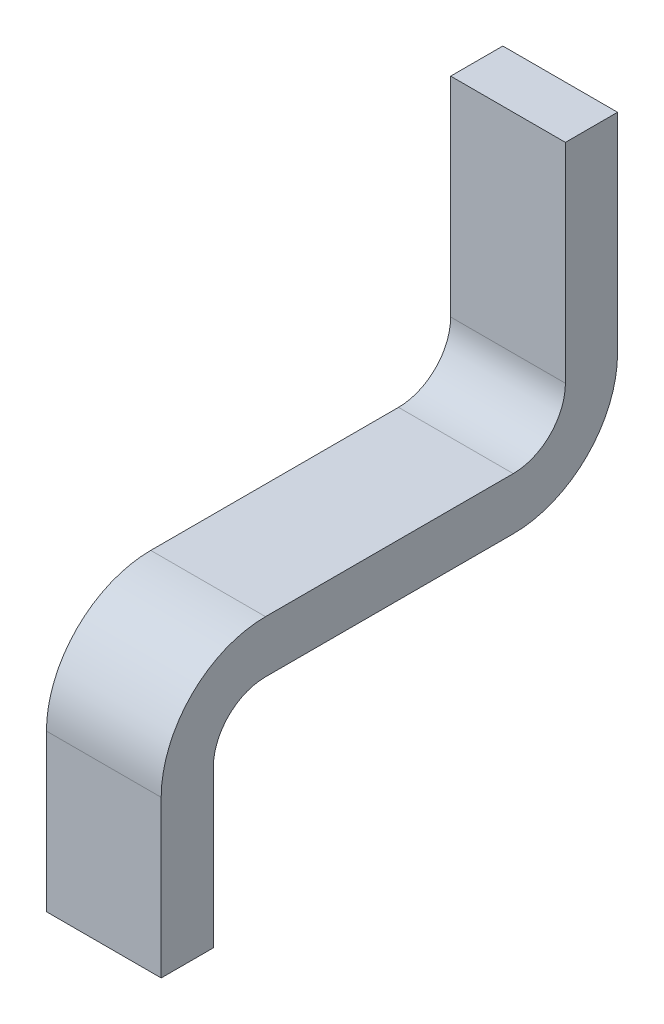
ISO-10303-21;
HEADER;
FILE_DESCRIPTION(('STEP AP214'),'2;1');
FILE_NAME('part.step','',(''),(''),'','','');
FILE_SCHEMA(('AUTOMOTIVE_DESIGN { 1 0 10303 214 1 1 1 1 }'));
ENDSEC;
DATA;
#1=APPLICATION_CONTEXT('core data for automotive mechanical design processes');
#2=APPLICATION_PROTOCOL_DEFINITION('international standard','automotive_design',2000,#1);
#3=PRODUCT_CONTEXT('',#1,'mechanical');
#4=PRODUCT('Part','Part','',(#3));
#5=PRODUCT_RELATED_PRODUCT_CATEGORY('part','',(#4));
#6=PRODUCT_DEFINITION_FORMATION('','',#4);
#7=PRODUCT_DEFINITION_CONTEXT('part definition',#1,'design');
#8=PRODUCT_DEFINITION('design','',#6,#7);
#9=PRODUCT_DEFINITION_SHAPE('','',#8);
#10=(LENGTH_UNIT() NAMED_UNIT(*) SI_UNIT(.MILLI.,.METRE.));
#11=(NAMED_UNIT(*) PLANE_ANGLE_UNIT() SI_UNIT($,.RADIAN.));
#12=(NAMED_UNIT(*) SI_UNIT($,.STERADIAN.) SOLID_ANGLE_UNIT());
#13=UNCERTAINTY_MEASURE_WITH_UNIT(LENGTH_MEASURE(1.E-05),#10,'distance_accuracy_value','');
#14=(GEOMETRIC_REPRESENTATION_CONTEXT(3) GLOBAL_UNCERTAINTY_ASSIGNED_CONTEXT((#13)) GLOBAL_UNIT_ASSIGNED_CONTEXT((#10,
#11,#12)) REPRESENTATION_CONTEXT('',''));
#15=CARTESIAN_POINT('',(0.,0.,0.));
#16=DIRECTION('',(0.,0.,1.));
#17=DIRECTION('',(1.,0.,0.));
#18=AXIS2_PLACEMENT_3D('',#15,#16,#17);
#19=CARTESIAN_POINT('',(1.36,4.,0.675));
#20=DIRECTION('',(-1.,0.,0.));
#21=DIRECTION('',(0.,-1.,0.));
#22=AXIS2_PLACEMENT_3D('',#19,#20,#21);
#23=PLANE('',#22);
#24=CARTESIAN_POINT('',(1.36,3.8,0.675));
#25=DIRECTION('',(1.,0.,0.));
#26=DIRECTION('',(0.,1.,0.));
#27=AXIS2_PLACEMENT_3D('',#24,#25,#26);
#28=CIRCLE('',#27,0.2);
#29=CARTESIAN_POINT('',(1.36,3.8,0.875));
#30=VERTEX_POINT('',#29);
#31=CARTESIAN_POINT('',(1.36,4.,0.675));
#32=VERTEX_POINT('',#31);
#33=EDGE_CURVE('E150',#30,#32,#28,.F.);
#34=ORIENTED_EDGE('',*,*,#33,.F.);
#35=DIRECTION('',(0.,1.,0.));
#36=VECTOR('',#35,1.);
#37=CARTESIAN_POINT('',(1.36,3.5,0.875));
#38=LINE('',#37,#36);
#39=CARTESIAN_POINT('',(1.36,3.5,0.875));
#40=VERTEX_POINT('',#39);
#41=EDGE_CURVE('E147',#30,#40,#38,.F.);
#42=ORIENTED_EDGE('',*,*,#41,.T.);
#43=DIRECTION('',(0.,0.,1.));
#44=VECTOR('',#43,1.);
#45=CARTESIAN_POINT('',(1.36,3.5,0.775));
#46=LINE('',#45,#44);
#47=CARTESIAN_POINT('',(1.36,3.5,0.775));
#48=VERTEX_POINT('',#47);
#49=EDGE_CURVE('E141',#48,#40,#46,.T.);
#50=ORIENTED_EDGE('',*,*,#49,.F.);
#51=DIRECTION('',(0.,1.,0.));
#52=VECTOR('',#51,1.);
#53=CARTESIAN_POINT('',(1.36,3.5,0.775));
#54=LINE('',#53,#52);
#55=CARTESIAN_POINT('',(1.36,3.8,0.775));
#56=VERTEX_POINT('',#55);
#57=EDGE_CURVE('E115',#48,#56,#54,.T.);
#58=ORIENTED_EDGE('',*,*,#57,.T.);
#59=CARTESIAN_POINT('',(1.36,3.8,0.675));
#60=DIRECTION('',(1.,0.,0.));
#61=DIRECTION('',(0.,1.,0.));
#62=AXIS2_PLACEMENT_3D('',#59,#60,#61);
#63=CIRCLE('',#62,0.1);
#64=CARTESIAN_POINT('',(1.36,3.9,0.675));
#65=VERTEX_POINT('',#64);
#66=EDGE_CURVE('E215',#56,#65,#63,.F.);
#67=ORIENTED_EDGE('',*,*,#66,.T.);
#68=DIRECTION('',(0.,0.,1.));
#69=VECTOR('',#68,1.);
#70=CARTESIAN_POINT('',(1.36,3.9,0.675));
#71=LINE('',#70,#69);
#72=CARTESIAN_POINT('',(1.36,3.9,0.2));
#73=VERTEX_POINT('',#72);
#74=EDGE_CURVE('E181',#65,#73,#71,.F.);
#75=ORIENTED_EDGE('',*,*,#74,.T.);
#76=CARTESIAN_POINT('',(1.36,4.1,0.2));
#77=DIRECTION('',(-1.,0.,0.));
#78=DIRECTION('',(0.,-1.,0.));
#79=AXIS2_PLACEMENT_3D('',#76,#77,#78);
#80=CIRCLE('',#79,0.2);
#81=CARTESIAN_POINT('',(1.36,4.1,0.));
#82=VERTEX_POINT('',#81);
#83=EDGE_CURVE('E20',#82,#73,#80,.T.);
#84=ORIENTED_EDGE('',*,*,#83,.F.);
#85=DIRECTION('',(0.,1.,0.));
#86=VECTOR('',#85,1.);
#87=CARTESIAN_POINT('',(1.36,4.1,0.));
#88=LINE('',#87,#86);
#89=CARTESIAN_POINT('',(1.36,4.5,0.));
#90=VERTEX_POINT('',#89);
#91=EDGE_CURVE('E91',#82,#90,#88,.T.);
#92=ORIENTED_EDGE('',*,*,#91,.T.);
#93=DIRECTION('',(0.,0.,1.));
#94=VECTOR('',#93,1.);
#95=CARTESIAN_POINT('',(1.36,4.5,0.));
#96=LINE('',#95,#94);
#97=CARTESIAN_POINT('',(1.36,4.5,0.1));
#98=VERTEX_POINT('',#97);
#99=EDGE_CURVE('E163',#90,#98,#96,.T.);
#100=ORIENTED_EDGE('',*,*,#99,.T.);
#101=DIRECTION('',(0.,1.,0.));
#102=VECTOR('',#101,1.);
#103=CARTESIAN_POINT('',(1.36,4.1,0.1));
#104=LINE('',#103,#102);
#105=CARTESIAN_POINT('',(1.36,4.1,0.1));
#106=VERTEX_POINT('',#105);
#107=EDGE_CURVE('E159',#98,#106,#104,.F.);
#108=ORIENTED_EDGE('',*,*,#107,.T.);
#109=CARTESIAN_POINT('',(1.36,4.1,0.2));
#110=DIRECTION('',(-1.,0.,0.));
#111=DIRECTION('',(0.,-1.,0.));
#112=AXIS2_PLACEMENT_3D('',#109,#110,#111);
#113=CIRCLE('',#112,0.1);
#114=CARTESIAN_POINT('',(1.36,4.,0.2));
#115=VERTEX_POINT('',#114);
#116=EDGE_CURVE('E155',#106,#115,#113,.T.);
#117=ORIENTED_EDGE('',*,*,#116,.T.);
#118=DIRECTION('',(0.,0.,1.));
#119=VECTOR('',#118,1.);
#120=CARTESIAN_POINT('',(1.36,4.,0.675));
#121=LINE('',#120,#119);
#122=EDGE_CURVE('E154',#115,#32,#121,.T.);
#123=ORIENTED_EDGE('',*,*,#122,.T.);
#124=EDGE_LOOP('',(#34,#42,#50,#58,#67,#75,#84,#92,#100,#108,#117,#123));
#125=FACE_BOUND('',#124,.T.);
#126=ADVANCED_FACE('F17',(#125),#23,.F.);
#127=CARTESIAN_POINT('',(1.36,4.1,0.2));
#128=DIRECTION('',(-1.,0.,0.));
#129=DIRECTION('',(0.,-1.,0.));
#130=AXIS2_PLACEMENT_3D('',#127,#128,#129);
#131=CYLINDRICAL_SURFACE('',#130,0.2);
#132=CARTESIAN_POINT('',(1.14,4.1,0.2));
#133=DIRECTION('',(-1.,0.,0.));
#134=DIRECTION('',(0.,-1.,0.));
#135=AXIS2_PLACEMENT_3D('',#132,#133,#134);
#136=CIRCLE('',#135,0.2);
#137=CARTESIAN_POINT('',(1.14,3.9,0.2));
#138=VERTEX_POINT('',#137);
#139=CARTESIAN_POINT('',(1.14,4.1,0.));
#140=VERTEX_POINT('',#139);
#141=EDGE_CURVE('E183',#138,#140,#136,.F.);
#142=ORIENTED_EDGE('',*,*,#141,.T.);
#143=DIRECTION('',(1.,0.,0.));
#144=VECTOR('',#143,1.);
#145=CARTESIAN_POINT('',(1.36,4.1,0.));
#146=LINE('',#145,#144);
#147=EDGE_CURVE('E178',#140,#82,#146,.T.);
#148=ORIENTED_EDGE('',*,*,#147,.T.);
#149=ORIENTED_EDGE('',*,*,#83,.T.);
#150=DIRECTION('',(-1.,0.,0.));
#151=VECTOR('',#150,1.);
#152=CARTESIAN_POINT('',(1.36,3.9,0.2));
#153=LINE('',#152,#151);
#154=EDGE_CURVE('E217',#73,#138,#153,.T.);
#155=ORIENTED_EDGE('',*,*,#154,.T.);
#156=EDGE_LOOP('',(#142,#148,#149,#155));
#157=FACE_BOUND('',#156,.T.);
#158=ADVANCED_FACE('F254',(#157),#131,.T.);
#159=CARTESIAN_POINT('',(1.36,4.1,0.));
#160=DIRECTION('',(0.,0.,1.));
#161=DIRECTION('',(1.,0.,0.));
#162=AXIS2_PLACEMENT_3D('',#159,#160,#161);
#163=PLANE('',#162);
#164=ORIENTED_EDGE('',*,*,#147,.F.);
#165=DIRECTION('',(0.,1.,0.));
#166=VECTOR('',#165,1.);
#167=CARTESIAN_POINT('',(1.14,3.9,0.));
#168=LINE('',#167,#166);
#169=CARTESIAN_POINT('',(1.14,4.5,0.));
#170=VERTEX_POINT('',#169);
#171=EDGE_CURVE('E170',#140,#170,#168,.T.);
#172=ORIENTED_EDGE('',*,*,#171,.T.);
#173=DIRECTION('',(1.,0.,0.));
#174=VECTOR('',#173,1.);
#175=CARTESIAN_POINT('',(1.36,4.5,0.));
#176=LINE('',#175,#174);
#177=EDGE_CURVE('E173',#170,#90,#176,.T.);
#178=ORIENTED_EDGE('',*,*,#177,.T.);
#179=ORIENTED_EDGE('',*,*,#91,.F.);
#180=EDGE_LOOP('',(#164,#172,#178,#179));
#181=FACE_BOUND('',#180,.T.);
#182=ADVANCED_FACE('F257',(#181),#163,.F.);
#183=CARTESIAN_POINT('',(1.36,4.5,0.));
#184=DIRECTION('',(0.,-1.,0.));
#185=DIRECTION('',(1.,0.,0.));
#186=AXIS2_PLACEMENT_3D('',#183,#184,#185);
#187=PLANE('',#186);
#188=DIRECTION('',(-1.,0.,0.));
#189=VECTOR('',#188,1.);
#190=CARTESIAN_POINT('',(1.14,4.5,0.1));
#191=LINE('',#190,#189);
#192=CARTESIAN_POINT('',(1.14,4.5,0.1));
#193=VERTEX_POINT('',#192);
#194=EDGE_CURVE('E160',#193,#98,#191,.F.);
#195=ORIENTED_EDGE('',*,*,#194,.T.);
#196=ORIENTED_EDGE('',*,*,#99,.F.);
#197=ORIENTED_EDGE('',*,*,#177,.F.);
#198=DIRECTION('',(0.,0.,1.));
#199=VECTOR('',#198,1.);
#200=CARTESIAN_POINT('',(1.14,4.5,0.675));
#201=LINE('',#200,#199);
#202=EDGE_CURVE('E166',#170,#193,#201,.T.);
#203=ORIENTED_EDGE('',*,*,#202,.T.);
#204=EDGE_LOOP('',(#195,#196,#197,#203));
#205=FACE_BOUND('',#204,.T.);
#206=ADVANCED_FACE('F259',(#205),#187,.F.);
#207=CARTESIAN_POINT('',(1.14,4.1,0.1));
#208=DIRECTION('',(0.,0.,-1.));
#209=DIRECTION('',(-1.,0.,0.));
#210=AXIS2_PLACEMENT_3D('',#207,#208,#209);
#211=PLANE('',#210);
#212=DIRECTION('',(-1.,0.,0.));
#213=VECTOR('',#212,1.);
#214=CARTESIAN_POINT('',(1.14,4.1,0.1));
#215=LINE('',#214,#213);
#216=CARTESIAN_POINT('',(1.14,4.1,0.1));
#217=VERTEX_POINT('',#216);
#218=EDGE_CURVE('E156',#217,#106,#215,.F.);
#219=ORIENTED_EDGE('',*,*,#218,.T.);
#220=ORIENTED_EDGE('',*,*,#107,.F.);
#221=ORIENTED_EDGE('',*,*,#194,.F.);
#222=DIRECTION('',(0.,1.,0.));
#223=VECTOR('',#222,1.);
#224=CARTESIAN_POINT('',(1.14,3.9,0.1));
#225=LINE('',#224,#223);
#226=EDGE_CURVE('E169',#193,#217,#225,.F.);
#227=ORIENTED_EDGE('',*,*,#226,.T.);
#228=EDGE_LOOP('',(#219,#220,#221,#227));
#229=FACE_BOUND('',#228,.T.);
#230=ADVANCED_FACE('F234',(#229),#211,.F.);
#231=CARTESIAN_POINT('',(1.14,4.1,0.2));
#232=DIRECTION('',(-1.,0.,0.));
#233=DIRECTION('',(0.,-1.,0.));
#234=AXIS2_PLACEMENT_3D('',#231,#232,#233);
#235=CYLINDRICAL_SURFACE('',#234,0.1);
#236=DIRECTION('',(1.,0.,0.));
#237=VECTOR('',#236,1.);
#238=CARTESIAN_POINT('',(1.14,4.,0.2));
#239=LINE('',#238,#237);
#240=CARTESIAN_POINT('',(1.14,4.,0.2));
#241=VERTEX_POINT('',#240);
#242=EDGE_CURVE('E151',#241,#115,#239,.T.);
#243=ORIENTED_EDGE('',*,*,#242,.T.);
#244=ORIENTED_EDGE('',*,*,#116,.F.);
#245=ORIENTED_EDGE('',*,*,#218,.F.);
#246=CARTESIAN_POINT('',(1.14,4.1,0.2));
#247=DIRECTION('',(-1.,0.,0.));
#248=DIRECTION('',(0.,-1.,0.));
#249=AXIS2_PLACEMENT_3D('',#246,#247,#248);
#250=CIRCLE('',#249,0.1);
#251=EDGE_CURVE('E210',#217,#241,#250,.T.);
#252=ORIENTED_EDGE('',*,*,#251,.T.);
#253=EDGE_LOOP('',(#243,#244,#245,#252));
#254=FACE_BOUND('',#253,.T.);
#255=ADVANCED_FACE('F227',(#254),#235,.F.);
#256=CARTESIAN_POINT('',(1.14,4.,0.675));
#257=DIRECTION('',(0.,-1.,0.));
#258=DIRECTION('',(1.,0.,0.));
#259=AXIS2_PLACEMENT_3D('',#256,#257,#258);
#260=PLANE('',#259);
#261=DIRECTION('',(1.,0.,0.));
#262=VECTOR('',#261,1.);
#263=CARTESIAN_POINT('',(1.14,4.,0.675));
#264=LINE('',#263,#262);
#265=CARTESIAN_POINT('',(1.14,4.,0.675));
#266=VERTEX_POINT('',#265);
#267=EDGE_CURVE('E148',#32,#266,#264,.F.);
#268=ORIENTED_EDGE('',*,*,#267,.F.);
#269=ORIENTED_EDGE('',*,*,#122,.F.);
#270=ORIENTED_EDGE('',*,*,#242,.F.);
#271=DIRECTION('',(0.,0.,1.));
#272=VECTOR('',#271,1.);
#273=CARTESIAN_POINT('',(1.14,4.,0.675));
#274=LINE('',#273,#272);
#275=EDGE_CURVE('E209',#241,#266,#274,.T.);
#276=ORIENTED_EDGE('',*,*,#275,.T.);
#277=EDGE_LOOP('',(#268,#269,#270,#276));
#278=FACE_BOUND('',#277,.T.);
#279=ADVANCED_FACE('F224',(#278),#260,.F.);
#280=CARTESIAN_POINT('',(1.14,3.80000000000001,0.675));
#281=DIRECTION('',(1.,0.,0.));
#282=DIRECTION('',(0.,1.,0.));
#283=AXIS2_PLACEMENT_3D('',#280,#281,#282);
#284=CYLINDRICAL_SURFACE('',#283,0.2);
#285=ORIENTED_EDGE('',*,*,#33,.T.);
#286=ORIENTED_EDGE('',*,*,#267,.T.);
#287=CARTESIAN_POINT('',(1.14,3.80000000000001,0.675));
#288=DIRECTION('',(1.,0.,0.));
#289=DIRECTION('',(0.,1.,0.));
#290=AXIS2_PLACEMENT_3D('',#287,#288,#289);
#291=CIRCLE('',#290,0.2);
#292=CARTESIAN_POINT('',(1.14,3.80000000000001,0.875));
#293=VERTEX_POINT('',#292);
#294=EDGE_CURVE('E133',#266,#293,#291,.T.);
#295=ORIENTED_EDGE('',*,*,#294,.T.);
#296=DIRECTION('',(-1.,0.,0.));
#297=VECTOR('',#296,1.);
#298=CARTESIAN_POINT('',(1.14,3.80000000000001,0.875));
#299=LINE('',#298,#297);
#300=EDGE_CURVE('E144',#293,#30,#299,.F.);
#301=ORIENTED_EDGE('',*,*,#300,.T.);
#302=EDGE_LOOP('',(#285,#286,#295,#301));
#303=FACE_BOUND('',#302,.T.);
#304=ADVANCED_FACE('F285',(#303),#284,.T.);
#305=CARTESIAN_POINT('',(1.14,3.5,0.875));
#306=DIRECTION('',(0.,0.,-1.));
#307=DIRECTION('',(-1.,0.,0.));
#308=AXIS2_PLACEMENT_3D('',#305,#306,#307);
#309=PLANE('',#308);
#310=DIRECTION('',(1.,0.,0.));
#311=VECTOR('',#310,1.);
#312=CARTESIAN_POINT('',(1.36,3.5,0.875));
#313=LINE('',#312,#311);
#314=CARTESIAN_POINT('',(1.14,3.5,0.875));
#315=VERTEX_POINT('',#314);
#316=EDGE_CURVE('E118',#40,#315,#313,.F.);
#317=ORIENTED_EDGE('',*,*,#316,.F.);
#318=ORIENTED_EDGE('',*,*,#41,.F.);
#319=ORIENTED_EDGE('',*,*,#300,.F.);
#320=DIRECTION('',(0.,1.,0.));
#321=VECTOR('',#320,1.);
#322=CARTESIAN_POINT('',(1.14,3.9,0.875));
#323=LINE('',#322,#321);
#324=EDGE_CURVE('E131',#293,#315,#323,.F.);
#325=ORIENTED_EDGE('',*,*,#324,.T.);
#326=EDGE_LOOP('',(#317,#318,#319,#325));
#327=FACE_BOUND('',#326,.T.);
#328=ADVANCED_FACE('F282',(#327),#309,.F.);
#329=CARTESIAN_POINT('',(1.36,3.5,0.775));
#330=DIRECTION('',(0.,-1.,0.));
#331=DIRECTION('',(1.,0.,0.));
#332=AXIS2_PLACEMENT_3D('',#329,#330,#331);
#333=PLANE('',#332);
#334=ORIENTED_EDGE('',*,*,#49,.T.);
#335=ORIENTED_EDGE('',*,*,#316,.T.);
#336=DIRECTION('',(0.,0.,1.));
#337=VECTOR('',#336,1.);
#338=CARTESIAN_POINT('',(1.14,3.5,0.675));
#339=LINE('',#338,#337);
#340=CARTESIAN_POINT('',(1.14,3.5,0.775));
#341=VERTEX_POINT('',#340);
#342=EDGE_CURVE('E125',#315,#341,#339,.F.);
#343=ORIENTED_EDGE('',*,*,#342,.T.);
#344=DIRECTION('',(1.,0.,0.));
#345=VECTOR('',#344,1.);
#346=CARTESIAN_POINT('',(1.36,3.5,0.775));
#347=LINE('',#346,#345);
#348=EDGE_CURVE('E110',#341,#48,#347,.T.);
#349=ORIENTED_EDGE('',*,*,#348,.T.);
#350=EDGE_LOOP('',(#334,#335,#343,#349));
#351=FACE_BOUND('',#350,.T.);
#352=ADVANCED_FACE('F129',(#351),#333,.T.);
#353=CARTESIAN_POINT('',(1.36,3.5,0.775));
#354=DIRECTION('',(0.,0.,1.));
#355=DIRECTION('',(1.,0.,0.));
#356=AXIS2_PLACEMENT_3D('',#353,#354,#355);
#357=PLANE('',#356);
#358=ORIENTED_EDGE('',*,*,#348,.F.);
#359=DIRECTION('',(0.,1.,0.));
#360=VECTOR('',#359,1.);
#361=CARTESIAN_POINT('',(1.14,3.9,0.775));
#362=LINE('',#361,#360);
#363=CARTESIAN_POINT('',(1.14,3.80000000000001,0.775));
#364=VERTEX_POINT('',#363);
#365=EDGE_CURVE('E114',#341,#364,#362,.T.);
#366=ORIENTED_EDGE('',*,*,#365,.T.);
#367=DIRECTION('',(1.,0.,0.));
#368=VECTOR('',#367,1.);
#369=CARTESIAN_POINT('',(1.36,3.8,0.775));
#370=LINE('',#369,#368);
#371=EDGE_CURVE('E185',#364,#56,#370,.T.);
#372=ORIENTED_EDGE('',*,*,#371,.T.);
#373=ORIENTED_EDGE('',*,*,#57,.F.);
#374=EDGE_LOOP('',(#358,#366,#372,#373));
#375=FACE_BOUND('',#374,.T.);
#376=ADVANCED_FACE('F112',(#375),#357,.F.);
#377=CARTESIAN_POINT('',(1.36,3.8,0.675));
#378=DIRECTION('',(1.,0.,0.));
#379=DIRECTION('',(0.,1.,0.));
#380=AXIS2_PLACEMENT_3D('',#377,#378,#379);
#381=CYLINDRICAL_SURFACE('',#380,0.1);
#382=ORIENTED_EDGE('',*,*,#371,.F.);
#383=CARTESIAN_POINT('',(1.14,3.80000000000001,0.675));
#384=DIRECTION('',(1.,0.,0.));
#385=DIRECTION('',(0.,1.,0.));
#386=AXIS2_PLACEMENT_3D('',#383,#384,#385);
#387=CIRCLE('',#386,0.1);
#388=CARTESIAN_POINT('',(1.14,3.9,0.675));
#389=VERTEX_POINT('',#388);
#390=EDGE_CURVE('E26',#364,#389,#387,.F.);
#391=ORIENTED_EDGE('',*,*,#390,.T.);
#392=DIRECTION('',(-1.,0.,0.));
#393=VECTOR('',#392,1.);
#394=CARTESIAN_POINT('',(1.36,3.9,0.675));
#395=LINE('',#394,#393);
#396=EDGE_CURVE('E34',#389,#65,#395,.F.);
#397=ORIENTED_EDGE('',*,*,#396,.T.);
#398=ORIENTED_EDGE('',*,*,#66,.F.);
#399=EDGE_LOOP('',(#382,#391,#397,#398));
#400=FACE_BOUND('',#399,.T.);
#401=ADVANCED_FACE('F250',(#400),#381,.F.);
#402=CARTESIAN_POINT('',(1.36,3.9,0.675));
#403=DIRECTION('',(0.,1.,0.));
#404=DIRECTION('',(-1.,0.,0.));
#405=AXIS2_PLACEMENT_3D('',#402,#403,#404);
#406=PLANE('',#405);
#407=ORIENTED_EDGE('',*,*,#396,.F.);
#408=DIRECTION('',(0.,0.,1.));
#409=VECTOR('',#408,1.);
#410=CARTESIAN_POINT('',(1.14,3.9,0.675));
#411=LINE('',#410,#409);
#412=EDGE_CURVE('E11',#389,#138,#411,.F.);
#413=ORIENTED_EDGE('',*,*,#412,.T.);
#414=ORIENTED_EDGE('',*,*,#154,.F.);
#415=ORIENTED_EDGE('',*,*,#74,.F.);
#416=EDGE_LOOP('',(#407,#413,#414,#415));
#417=FACE_BOUND('',#416,.T.);
#418=ADVANCED_FACE('F252',(#417),#406,.F.);
#419=CARTESIAN_POINT('',(1.14,3.9,0.675));
#420=DIRECTION('',(1.,0.,0.));
#421=DIRECTION('',(0.,1.,0.));
#422=AXIS2_PLACEMENT_3D('',#419,#420,#421);
#423=PLANE('',#422);
#424=ORIENTED_EDGE('',*,*,#390,.F.);
#425=ORIENTED_EDGE('',*,*,#365,.F.);
#426=ORIENTED_EDGE('',*,*,#342,.F.);
#427=ORIENTED_EDGE('',*,*,#324,.F.);
#428=ORIENTED_EDGE('',*,*,#294,.F.);
#429=ORIENTED_EDGE('',*,*,#275,.F.);
#430=ORIENTED_EDGE('',*,*,#251,.F.);
#431=ORIENTED_EDGE('',*,*,#226,.F.);
#432=ORIENTED_EDGE('',*,*,#202,.F.);
#433=ORIENTED_EDGE('',*,*,#171,.F.);
#434=ORIENTED_EDGE('',*,*,#141,.F.);
#435=ORIENTED_EDGE('',*,*,#412,.F.);
#436=EDGE_LOOP('',(#424,#425,#426,#427,#428,#429,#430,#431,#432,#433,#434,#435));
#437=FACE_BOUND('',#436,.T.);
#438=ADVANCED_FACE('F123',(#437),#423,.F.);
#439=CLOSED_SHELL('',(#126,#158,#182,#206,#230,#255,#279,#304,#328,#352,#376,#401,#418,#438));
#440=MANIFOLD_SOLID_BREP('B1',#439);
#441=ADVANCED_BREP_SHAPE_REPRESENTATION('',(#18,#440),#14);
#442=SHAPE_DEFINITION_REPRESENTATION(#9,#441);
ENDSEC;
END-ISO-10303-21;
